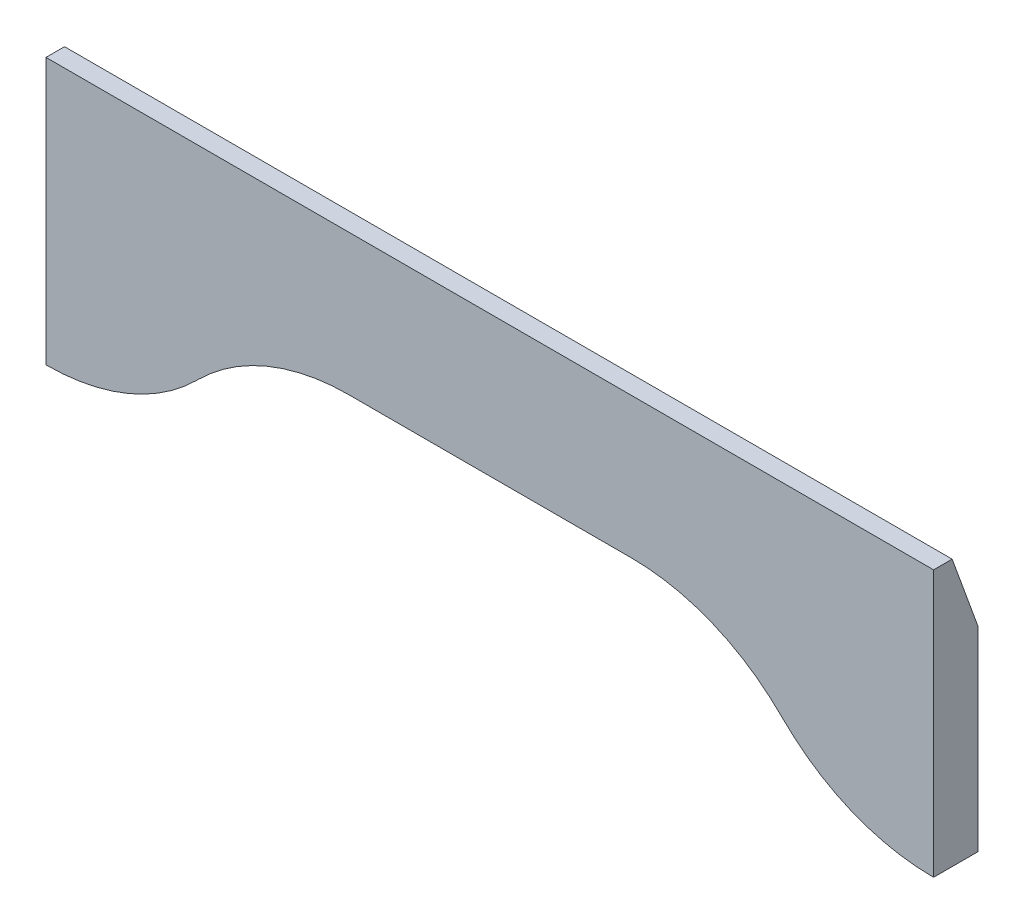
ISO-10303-21;
HEADER;
FILE_DESCRIPTION(('STEP AP214'),'2;1');
FILE_NAME('part.step','',(''),(''),'','','');
FILE_SCHEMA(('AUTOMOTIVE_DESIGN { 1 0 10303 214 1 1 1 1 }'));
ENDSEC;
DATA;
#1=APPLICATION_CONTEXT('core data for automotive mechanical design processes');
#2=APPLICATION_PROTOCOL_DEFINITION('international standard','automotive_design',2000,#1);
#3=PRODUCT_CONTEXT('',#1,'mechanical');
#4=PRODUCT('Part','Part','',(#3));
#5=PRODUCT_RELATED_PRODUCT_CATEGORY('part','',(#4));
#6=PRODUCT_DEFINITION_FORMATION('','',#4);
#7=PRODUCT_DEFINITION_CONTEXT('part definition',#1,'design');
#8=PRODUCT_DEFINITION('design','',#6,#7);
#9=PRODUCT_DEFINITION_SHAPE('','',#8);
#10=(LENGTH_UNIT() NAMED_UNIT(*) SI_UNIT(.MILLI.,.METRE.));
#11=(NAMED_UNIT(*) PLANE_ANGLE_UNIT() SI_UNIT($,.RADIAN.));
#12=(NAMED_UNIT(*) SI_UNIT($,.STERADIAN.) SOLID_ANGLE_UNIT());
#13=UNCERTAINTY_MEASURE_WITH_UNIT(LENGTH_MEASURE(1.E-05),#10,'distance_accuracy_value','');
#14=(GEOMETRIC_REPRESENTATION_CONTEXT(3) GLOBAL_UNCERTAINTY_ASSIGNED_CONTEXT((#13)) GLOBAL_UNIT_ASSIGNED_CONTEXT((#10,
#11,#12)) REPRESENTATION_CONTEXT('',''));
#15=CARTESIAN_POINT('',(0.,0.,0.));
#16=DIRECTION('',(0.,0.,1.));
#17=DIRECTION('',(1.,0.,0.));
#18=AXIS2_PLACEMENT_3D('',#15,#16,#17);
#19=CARTESIAN_POINT('',(0.,0.,6.35));
#20=DIRECTION('',(0.,1.,0.));
#21=DIRECTION('',(0.,0.,1.));
#22=AXIS2_PLACEMENT_3D('',#19,#20,#21);
#23=PLANE('',#22);
#24=DIRECTION('',(1.,0.,0.));
#25=VECTOR('',#24,1.);
#26=CARTESIAN_POINT('',(0.,0.,0.));
#27=LINE('',#26,#25);
#28=CARTESIAN_POINT('',(0.,0.,0.));
#29=VERTEX_POINT('',#28);
#30=CARTESIAN_POINT('',(0.0747706188680307,0.,0.));
#31=VERTEX_POINT('',#30);
#32=EDGE_CURVE('E207',#29,#31,#27,.T.);
#33=ORIENTED_EDGE('',*,*,#32,.T.);
#34=DIRECTION('',(0.,0.,1.));
#35=VECTOR('',#34,1.);
#36=CARTESIAN_POINT('',(0.0747706188680307,0.,6.35));
#37=LINE('',#36,#35);
#38=CARTESIAN_POINT('',(0.0747706188680307,0.,6.35));
#39=VERTEX_POINT('',#38);
#40=EDGE_CURVE('E134',#31,#39,#37,.T.);
#41=ORIENTED_EDGE('',*,*,#40,.T.);
#42=DIRECTION('',(1.,0.,0.));
#43=VECTOR('',#42,1.);
#44=CARTESIAN_POINT('',(0.,0.,6.35));
#45=LINE('',#44,#43);
#46=CARTESIAN_POINT('',(0.,0.,6.35));
#47=VERTEX_POINT('',#46);
#48=EDGE_CURVE('E128',#47,#39,#45,.T.);
#49=ORIENTED_EDGE('',*,*,#48,.F.);
#50=DIRECTION('',(0.,0.,-1.));
#51=VECTOR('',#50,1.);
#52=CARTESIAN_POINT('',(0.,0.,6.35));
#53=LINE('',#52,#51);
#54=EDGE_CURVE('E132',#47,#29,#53,.T.);
#55=ORIENTED_EDGE('',*,*,#54,.T.);
#56=EDGE_LOOP('',(#33,#41,#49,#55));
#57=FACE_BOUND('',#56,.T.);
#58=ADVANCED_FACE('F33',(#57),#23,.F.);
#59=CARTESIAN_POINT('',(0.,0.,6.35));
#60=DIRECTION('',(1.,0.,0.));
#61=DIRECTION('',(0.,0.,-1.));
#62=AXIS2_PLACEMENT_3D('',#59,#60,#61);
#63=PLANE('',#62);
#64=DIRECTION('',(0.,0.,-1.));
#65=VECTOR('',#64,1.);
#66=CARTESIAN_POINT('',(0.,38.1,6.35));
#67=LINE('',#66,#65);
#68=CARTESIAN_POINT('',(0.,38.1,6.35));
#69=VERTEX_POINT('',#68);
#70=CARTESIAN_POINT('',(0.,38.1,3.69793758014461));
#71=VERTEX_POINT('',#70);
#72=EDGE_CURVE('E199',#69,#71,#67,.T.);
#73=ORIENTED_EDGE('',*,*,#72,.T.);
#74=DIRECTION('',(0.,-0.939692620785909,-0.342020143325667));
#75=VECTOR('',#74,1.);
#76=CARTESIAN_POINT('',(0.,38.1,3.69793758014461));
#77=LINE('',#76,#75);
#78=CARTESIAN_POINT('',(0.,27.9399999999999,0.));
#79=VERTEX_POINT('',#78);
#80=EDGE_CURVE('E55',#71,#79,#77,.T.);
#81=ORIENTED_EDGE('',*,*,#80,.T.);
#82=DIRECTION('',(0.,-1.,0.));
#83=VECTOR('',#82,1.);
#84=CARTESIAN_POINT('',(0.,0.,0.));
#85=LINE('',#84,#83);
#86=EDGE_CURVE('E149',#79,#29,#85,.T.);
#87=ORIENTED_EDGE('',*,*,#86,.T.);
#88=ORIENTED_EDGE('',*,*,#54,.F.);
#89=DIRECTION('',(0.,-1.,0.));
#90=VECTOR('',#89,1.);
#91=CARTESIAN_POINT('',(0.,0.,6.35));
#92=LINE('',#91,#90);
#93=EDGE_CURVE('E140',#69,#47,#92,.T.);
#94=ORIENTED_EDGE('',*,*,#93,.F.);
#95=EDGE_LOOP('',(#73,#81,#87,#88,#94));
#96=FACE_BOUND('',#95,.T.);
#97=ADVANCED_FACE('F148',(#96),#63,.F.);
#98=CARTESIAN_POINT('',(126.925229381132,0.,6.35));
#99=VERTEX_POINT('',#98);
#100=CARTESIAN_POINT('',(127.,0.,6.35));
#101=VERTEX_POINT('',#100);
#102=EDGE_CURVE('E137',#99,#101,#45,.T.);
#103=ORIENTED_EDGE('',*,*,#102,.F.);
#104=DIRECTION('',(0.,0.,1.));
#105=VECTOR('',#104,1.);
#106=CARTESIAN_POINT('',(126.925229381132,0.,6.35));
#107=LINE('',#106,#105);
#108=CARTESIAN_POINT('',(126.925229381132,0.,0.));
#109=VERTEX_POINT('',#108);
#110=EDGE_CURVE('E167',#99,#109,#107,.F.);
#111=ORIENTED_EDGE('',*,*,#110,.T.);
#112=CARTESIAN_POINT('',(127.,0.,0.));
#113=VERTEX_POINT('',#112);
#114=EDGE_CURVE('E209',#109,#113,#27,.T.);
#115=ORIENTED_EDGE('',*,*,#114,.T.);
#116=DIRECTION('',(0.,0.,-1.));
#117=VECTOR('',#116,1.);
#118=CARTESIAN_POINT('',(127.,0.,6.35));
#119=LINE('',#118,#117);
#120=EDGE_CURVE('E152',#101,#113,#119,.T.);
#121=ORIENTED_EDGE('',*,*,#120,.F.);
#122=EDGE_LOOP('',(#103,#111,#115,#121));
#123=FACE_BOUND('',#122,.T.);
#124=ADVANCED_FACE('F265',(#123),#23,.F.);
#125=CARTESIAN_POINT('',(127.,0.,6.35));
#126=DIRECTION('',(-1.,0.,0.));
#127=DIRECTION('',(0.,0.,1.));
#128=AXIS2_PLACEMENT_3D('',#125,#126,#127);
#129=PLANE('',#128);
#130=DIRECTION('',(0.,1.,0.));
#131=VECTOR('',#130,1.);
#132=CARTESIAN_POINT('',(127.,0.,0.));
#133=LINE('',#132,#131);
#134=CARTESIAN_POINT('',(127.,27.9399999999999,0.));
#135=VERTEX_POINT('',#134);
#136=EDGE_CURVE('E146',#113,#135,#133,.T.);
#137=ORIENTED_EDGE('',*,*,#136,.T.);
#138=DIRECTION('',(0.,0.939692620785909,0.342020143325667));
#139=VECTOR('',#138,1.);
#140=CARTESIAN_POINT('',(127.,38.1,3.69793758014461));
#141=LINE('',#140,#139);
#142=CARTESIAN_POINT('',(127.,38.1,3.69793758014461));
#143=VERTEX_POINT('',#142);
#144=EDGE_CURVE('E11',#135,#143,#141,.T.);
#145=ORIENTED_EDGE('',*,*,#144,.T.);
#146=DIRECTION('',(0.,0.,-1.));
#147=VECTOR('',#146,1.);
#148=CARTESIAN_POINT('',(127.,38.1,6.35));
#149=LINE('',#148,#147);
#150=CARTESIAN_POINT('',(127.,38.1,6.35));
#151=VERTEX_POINT('',#150);
#152=EDGE_CURVE('E157',#151,#143,#149,.T.);
#153=ORIENTED_EDGE('',*,*,#152,.F.);
#154=DIRECTION('',(0.,1.,0.));
#155=VECTOR('',#154,1.);
#156=CARTESIAN_POINT('',(127.,0.,6.35));
#157=LINE('',#156,#155);
#158=EDGE_CURVE('E136',#101,#151,#157,.T.);
#159=ORIENTED_EDGE('',*,*,#158,.F.);
#160=ORIENTED_EDGE('',*,*,#120,.T.);
#161=EDGE_LOOP('',(#137,#145,#153,#159,#160));
#162=FACE_BOUND('',#161,.T.);
#163=ADVANCED_FACE('F272',(#162),#129,.F.);
#164=CARTESIAN_POINT('',(0.,38.1,6.35));
#165=DIRECTION('',(0.,-1.,0.));
#166=DIRECTION('',(0.,0.,-1.));
#167=AXIS2_PLACEMENT_3D('',#164,#165,#166);
#168=PLANE('',#167);
#169=ORIENTED_EDGE('',*,*,#152,.T.);
#170=DIRECTION('',(-1.,0.,0.));
#171=VECTOR('',#170,1.);
#172=CARTESIAN_POINT('',(0.,38.1,3.69793758014461));
#173=LINE('',#172,#171);
#174=EDGE_CURVE('E192',#143,#71,#173,.T.);
#175=ORIENTED_EDGE('',*,*,#174,.T.);
#176=ORIENTED_EDGE('',*,*,#72,.F.);
#177=DIRECTION('',(-1.,0.,0.));
#178=VECTOR('',#177,1.);
#179=CARTESIAN_POINT('',(0.,38.1,6.35));
#180=LINE('',#179,#178);
#181=EDGE_CURVE('E144',#151,#69,#180,.T.);
#182=ORIENTED_EDGE('',*,*,#181,.F.);
#183=EDGE_LOOP('',(#169,#175,#176,#182));
#184=FACE_BOUND('',#183,.T.);
#185=ADVANCED_FACE('F198',(#184),#168,.F.);
#186=CARTESIAN_POINT('',(0.,0.,6.35));
#187=DIRECTION('',(0.,0.,-1.));
#188=DIRECTION('',(-1.,0.,0.));
#189=AXIS2_PLACEMENT_3D('',#186,#187,#188);
#190=PLANE('',#189);
#191=DIRECTION('',(-0.707106781186547,0.707106781186548,0.));
#192=VECTOR('',#191,1.);
#193=CARTESIAN_POINT('',(96.3394877578617,17.9605122421383,6.35));
#194=LINE('',#193,#192);
#195=CARTESIAN_POINT('',(105.372614690566,8.92738530943406,6.35));
#196=VERTEX_POINT('',#195);
#197=CARTESIAN_POINT('',(105.266873067296,9.03312693270428,6.35));
#198=VERTEX_POINT('',#197);
#199=EDGE_CURVE('E220',#196,#198,#194,.T.);
#200=ORIENTED_EDGE('',*,*,#199,.F.);
#201=CARTESIAN_POINT('',(126.925229381132,30.48,6.35));
#202=DIRECTION('',(0.,0.,-1.));
#203=DIRECTION('',(-1.,0.,0.));
#204=AXIS2_PLACEMENT_3D('',#201,#202,#203);
#205=CIRCLE('',#204,30.48);
#206=EDGE_CURVE('E165',#196,#99,#205,.F.);
#207=ORIENTED_EDGE('',*,*,#206,.T.);
#208=ORIENTED_EDGE('',*,*,#102,.T.);
#209=ORIENTED_EDGE('',*,*,#158,.T.);
#210=ORIENTED_EDGE('',*,*,#181,.T.);
#211=ORIENTED_EDGE('',*,*,#93,.T.);
#212=ORIENTED_EDGE('',*,*,#48,.T.);
#213=CARTESIAN_POINT('',(0.0747706188680307,30.48,6.35));
#214=DIRECTION('',(0.,0.,-1.));
#215=DIRECTION('',(-1.,0.,0.));
#216=AXIS2_PLACEMENT_3D('',#213,#214,#215);
#217=CIRCLE('',#216,30.48);
#218=CARTESIAN_POINT('',(21.627385309434,8.92738530943407,6.35));
#219=VERTEX_POINT('',#218);
#220=EDGE_CURVE('E163',#39,#219,#217,.F.);
#221=ORIENTED_EDGE('',*,*,#220,.T.);
#222=DIRECTION('',(-0.707106781186546,-0.707106781186549,0.));
#223=VECTOR('',#222,1.);
#224=CARTESIAN_POINT('',(12.7,0.,6.35));
#225=LINE('',#224,#223);
#226=CARTESIAN_POINT('',(21.7331269327042,9.03312693270427,6.35));
#227=VERTEX_POINT('',#226);
#228=EDGE_CURVE('E213',#227,#219,#225,.T.);
#229=ORIENTED_EDGE('',*,*,#228,.F.);
#230=CARTESIAN_POINT('',(43.2857416232702,-12.5194877578617,6.35));
#231=DIRECTION('',(0.,0.,-1.));
#232=DIRECTION('',(-1.,0.,0.));
#233=AXIS2_PLACEMENT_3D('',#230,#231,#232);
#234=CIRCLE('',#233,30.48);
#235=CARTESIAN_POINT('',(43.2857416232702,17.9605122421383,6.35));
#236=VERTEX_POINT('',#235);
#237=EDGE_CURVE('E188',#227,#236,#234,.T.);
#238=ORIENTED_EDGE('',*,*,#237,.T.);
#239=DIRECTION('',(-1.,0.,0.));
#240=VECTOR('',#239,1.);
#241=CARTESIAN_POINT('',(30.6605122421383,17.9605122421383,6.35));
#242=LINE('',#241,#240);
#243=CARTESIAN_POINT('',(83.7142583767298,17.9605122421383,6.35));
#244=VERTEX_POINT('',#243);
#245=EDGE_CURVE('E217',#244,#236,#242,.T.);
#246=ORIENTED_EDGE('',*,*,#245,.F.);
#247=CARTESIAN_POINT('',(83.7142583767298,-12.5194877578617,6.35));
#248=DIRECTION('',(0.,0.,-1.));
#249=DIRECTION('',(-1.,0.,0.));
#250=AXIS2_PLACEMENT_3D('',#247,#248,#249);
#251=CIRCLE('',#250,30.48);
#252=EDGE_CURVE('E184',#244,#198,#251,.T.);
#253=ORIENTED_EDGE('',*,*,#252,.T.);
#254=EDGE_LOOP('',(#200,#207,#208,#209,#210,#211,#212,#221,#229,#238,#246,#253));
#255=FACE_BOUND('',#254,.T.);
#256=ADVANCED_FACE('F142',(#255),#190,.F.);
#257=CARTESIAN_POINT('',(0.,0.,0.));
#258=DIRECTION('',(0.,0.,-1.));
#259=DIRECTION('',(-1.,0.,0.));
#260=AXIS2_PLACEMENT_3D('',#257,#258,#259);
#261=PLANE('',#260);
#262=ORIENTED_EDGE('',*,*,#86,.F.);
#263=DIRECTION('',(1.,0.,0.));
#264=VECTOR('',#263,1.);
#265=CARTESIAN_POINT('',(127.,27.9399999999999,0.));
#266=LINE('',#265,#264);
#267=EDGE_CURVE('E41',#79,#135,#266,.T.);
#268=ORIENTED_EDGE('',*,*,#267,.T.);
#269=ORIENTED_EDGE('',*,*,#136,.F.);
#270=ORIENTED_EDGE('',*,*,#114,.F.);
#271=CARTESIAN_POINT('',(126.925229381132,30.48,0.));
#272=DIRECTION('',(0.,0.,-1.));
#273=DIRECTION('',(-1.,0.,0.));
#274=AXIS2_PLACEMENT_3D('',#271,#272,#273);
#275=CIRCLE('',#274,30.48);
#276=CARTESIAN_POINT('',(105.372614690566,8.92738530943406,0.));
#277=VERTEX_POINT('',#276);
#278=EDGE_CURVE('E171',#109,#277,#275,.T.);
#279=ORIENTED_EDGE('',*,*,#278,.T.);
#280=DIRECTION('',(-0.707106781186547,0.707106781186548,0.));
#281=VECTOR('',#280,1.);
#282=CARTESIAN_POINT('',(96.3394877578617,17.9605122421383,0.));
#283=LINE('',#282,#281);
#284=CARTESIAN_POINT('',(105.266873067296,9.03312693270428,0.));
#285=VERTEX_POINT('',#284);
#286=EDGE_CURVE('E216',#277,#285,#283,.T.);
#287=ORIENTED_EDGE('',*,*,#286,.T.);
#288=CARTESIAN_POINT('',(83.7142583767298,-12.5194877578617,0.));
#289=DIRECTION('',(0.,0.,-1.));
#290=DIRECTION('',(-1.,0.,0.));
#291=AXIS2_PLACEMENT_3D('',#288,#289,#290);
#292=CIRCLE('',#291,30.48);
#293=CARTESIAN_POINT('',(83.7142583767298,17.9605122421383,0.));
#294=VERTEX_POINT('',#293);
#295=EDGE_CURVE('E186',#285,#294,#292,.F.);
#296=ORIENTED_EDGE('',*,*,#295,.T.);
#297=DIRECTION('',(-1.,0.,0.));
#298=VECTOR('',#297,1.);
#299=CARTESIAN_POINT('',(30.6605122421383,17.9605122421383,0.));
#300=LINE('',#299,#298);
#301=CARTESIAN_POINT('',(43.2857416232702,17.9605122421383,0.));
#302=VERTEX_POINT('',#301);
#303=EDGE_CURVE('E225',#294,#302,#300,.T.);
#304=ORIENTED_EDGE('',*,*,#303,.T.);
#305=CARTESIAN_POINT('',(43.2857416232702,-12.5194877578617,0.));
#306=DIRECTION('',(0.,0.,-1.));
#307=DIRECTION('',(-1.,0.,0.));
#308=AXIS2_PLACEMENT_3D('',#305,#306,#307);
#309=CIRCLE('',#308,30.48);
#310=CARTESIAN_POINT('',(21.7331269327042,9.03312693270427,0.));
#311=VERTEX_POINT('',#310);
#312=EDGE_CURVE('E190',#302,#311,#309,.F.);
#313=ORIENTED_EDGE('',*,*,#312,.T.);
#314=DIRECTION('',(-0.707106781186546,-0.707106781186549,0.));
#315=VECTOR('',#314,1.);
#316=CARTESIAN_POINT('',(12.7,0.,0.));
#317=LINE('',#316,#315);
#318=CARTESIAN_POINT('',(21.627385309434,8.92738530943407,0.));
#319=VERTEX_POINT('',#318);
#320=EDGE_CURVE('E210',#311,#319,#317,.T.);
#321=ORIENTED_EDGE('',*,*,#320,.T.);
#322=CARTESIAN_POINT('',(0.0747706188680307,30.48,0.));
#323=DIRECTION('',(0.,0.,-1.));
#324=DIRECTION('',(-1.,0.,0.));
#325=AXIS2_PLACEMENT_3D('',#322,#323,#324);
#326=CIRCLE('',#325,30.48);
#327=EDGE_CURVE('E169',#319,#31,#326,.T.);
#328=ORIENTED_EDGE('',*,*,#327,.T.);
#329=ORIENTED_EDGE('',*,*,#32,.F.);
#330=EDGE_LOOP('',(#262,#268,#269,#270,#279,#287,#296,#304,#313,#321,#328,#329));
#331=FACE_BOUND('',#330,.T.);
#332=ADVANCED_FACE('F231',(#331),#261,.T.);
#333=CARTESIAN_POINT('',(12.7,0.,0.));
#334=DIRECTION('',(-0.707106781186549,0.707106781186546,0.));
#335=DIRECTION('',(-0.707106781186546,-0.707106781186549,0.));
#336=AXIS2_PLACEMENT_3D('',#333,#334,#335);
#337=PLANE('',#336);
#338=ORIENTED_EDGE('',*,*,#320,.F.);
#339=DIRECTION('',(0.,0.,1.));
#340=VECTOR('',#339,1.);
#341=CARTESIAN_POINT('',(21.7331269327042,9.03312693270427,6.35));
#342=LINE('',#341,#340);
#343=EDGE_CURVE('E180',#311,#227,#342,.T.);
#344=ORIENTED_EDGE('',*,*,#343,.T.);
#345=ORIENTED_EDGE('',*,*,#228,.T.);
#346=DIRECTION('',(0.,0.,1.));
#347=VECTOR('',#346,1.);
#348=CARTESIAN_POINT('',(21.627385309434,8.92738530943407,0.));
#349=LINE('',#348,#347);
#350=EDGE_CURVE('E178',#219,#319,#349,.F.);
#351=ORIENTED_EDGE('',*,*,#350,.T.);
#352=EDGE_LOOP('',(#338,#344,#345,#351));
#353=FACE_BOUND('',#352,.T.);
#354=ADVANCED_FACE('F252',(#353),#337,.F.);
#355=CARTESIAN_POINT('',(30.6605122421383,17.9605122421383,0.));
#356=DIRECTION('',(0.,1.,0.));
#357=DIRECTION('',(0.,0.,1.));
#358=AXIS2_PLACEMENT_3D('',#355,#356,#357);
#359=PLANE('',#358);
#360=ORIENTED_EDGE('',*,*,#303,.F.);
#361=DIRECTION('',(0.,0.,1.));
#362=VECTOR('',#361,1.);
#363=CARTESIAN_POINT('',(83.7142583767298,17.9605122421383,6.35));
#364=LINE('',#363,#362);
#365=EDGE_CURVE('E175',#294,#244,#364,.T.);
#366=ORIENTED_EDGE('',*,*,#365,.T.);
#367=ORIENTED_EDGE('',*,*,#245,.T.);
#368=DIRECTION('',(0.,0.,1.));
#369=VECTOR('',#368,1.);
#370=CARTESIAN_POINT('',(43.2857416232702,17.9605122421383,0.));
#371=LINE('',#370,#369);
#372=EDGE_CURVE('E173',#236,#302,#371,.F.);
#373=ORIENTED_EDGE('',*,*,#372,.T.);
#374=EDGE_LOOP('',(#360,#366,#367,#373));
#375=FACE_BOUND('',#374,.T.);
#376=ADVANCED_FACE('F243',(#375),#359,.F.);
#377=CARTESIAN_POINT('',(96.3394877578617,17.9605122421383,0.));
#378=DIRECTION('',(0.707106781186548,0.707106781186547,0.));
#379=DIRECTION('',(-0.707106781186547,0.707106781186548,0.));
#380=AXIS2_PLACEMENT_3D('',#377,#378,#379);
#381=PLANE('',#380);
#382=ORIENTED_EDGE('',*,*,#286,.F.);
#383=DIRECTION('',(0.,0.,1.));
#384=VECTOR('',#383,1.);
#385=CARTESIAN_POINT('',(105.372614690566,8.92738530943406,0.));
#386=LINE('',#385,#384);
#387=EDGE_CURVE('E154',#277,#196,#386,.T.);
#388=ORIENTED_EDGE('',*,*,#387,.T.);
#389=ORIENTED_EDGE('',*,*,#199,.T.);
#390=DIRECTION('',(0.,0.,1.));
#391=VECTOR('',#390,1.);
#392=CARTESIAN_POINT('',(105.266873067296,9.03312693270428,0.));
#393=LINE('',#392,#391);
#394=EDGE_CURVE('E151',#198,#285,#393,.F.);
#395=ORIENTED_EDGE('',*,*,#394,.T.);
#396=EDGE_LOOP('',(#382,#388,#389,#395));
#397=FACE_BOUND('',#396,.T.);
#398=ADVANCED_FACE('F284',(#397),#381,.F.);
#399=CARTESIAN_POINT('',(126.925229381132,30.48,0.));
#400=DIRECTION('',(0.,0.,1.));
#401=DIRECTION('',(1.,0.,0.));
#402=AXIS2_PLACEMENT_3D('',#399,#400,#401);
#403=CYLINDRICAL_SURFACE('',#402,30.48);
#404=ORIENTED_EDGE('',*,*,#278,.F.);
#405=ORIENTED_EDGE('',*,*,#110,.F.);
#406=ORIENTED_EDGE('',*,*,#206,.F.);
#407=ORIENTED_EDGE('',*,*,#387,.F.);
#408=EDGE_LOOP('',(#404,#405,#406,#407));
#409=FACE_BOUND('',#408,.T.);
#410=ADVANCED_FACE('F283',(#409),#403,.T.);
#411=CARTESIAN_POINT('',(83.7142583767298,-12.5194877578617,0.));
#412=DIRECTION('',(0.,0.,-1.));
#413=DIRECTION('',(-1.,0.,0.));
#414=AXIS2_PLACEMENT_3D('',#411,#412,#413);
#415=CYLINDRICAL_SURFACE('',#414,30.48);
#416=ORIENTED_EDGE('',*,*,#295,.F.);
#417=ORIENTED_EDGE('',*,*,#394,.F.);
#418=ORIENTED_EDGE('',*,*,#252,.F.);
#419=ORIENTED_EDGE('',*,*,#365,.F.);
#420=EDGE_LOOP('',(#416,#417,#418,#419));
#421=FACE_BOUND('',#420,.T.);
#422=ADVANCED_FACE('F240',(#421),#415,.F.);
#423=CARTESIAN_POINT('',(43.2857416232702,-12.5194877578617,0.));
#424=DIRECTION('',(0.,0.,-1.));
#425=DIRECTION('',(-1.,0.,0.));
#426=AXIS2_PLACEMENT_3D('',#423,#424,#425);
#427=CYLINDRICAL_SURFACE('',#426,30.48);
#428=ORIENTED_EDGE('',*,*,#312,.F.);
#429=ORIENTED_EDGE('',*,*,#372,.F.);
#430=ORIENTED_EDGE('',*,*,#237,.F.);
#431=ORIENTED_EDGE('',*,*,#343,.F.);
#432=EDGE_LOOP('',(#428,#429,#430,#431));
#433=FACE_BOUND('',#432,.T.);
#434=ADVANCED_FACE('F249',(#433),#427,.F.);
#435=CARTESIAN_POINT('',(0.0747706188680307,30.48,6.35));
#436=DIRECTION('',(0.,0.,1.));
#437=DIRECTION('',(1.,0.,0.));
#438=AXIS2_PLACEMENT_3D('',#435,#436,#437);
#439=CYLINDRICAL_SURFACE('',#438,30.48);
#440=ORIENTED_EDGE('',*,*,#327,.F.);
#441=ORIENTED_EDGE('',*,*,#350,.F.);
#442=ORIENTED_EDGE('',*,*,#220,.F.);
#443=ORIENTED_EDGE('',*,*,#40,.F.);
#444=EDGE_LOOP('',(#440,#441,#442,#443));
#445=FACE_BOUND('',#444,.T.);
#446=ADVANCED_FACE('F256',(#445),#439,.T.);
#447=CARTESIAN_POINT('',(0.,38.1,3.69793758014461));
#448=DIRECTION('',(0.,0.342020143325667,-0.939692620785909));
#449=DIRECTION('',(1.,0.,0.));
#450=AXIS2_PLACEMENT_3D('',#447,#448,#449);
#451=PLANE('',#450);
#452=ORIENTED_EDGE('',*,*,#144,.F.);
#453=ORIENTED_EDGE('',*,*,#267,.F.);
#454=ORIENTED_EDGE('',*,*,#80,.F.);
#455=ORIENTED_EDGE('',*,*,#174,.F.);
#456=EDGE_LOOP('',(#452,#453,#454,#455));
#457=FACE_BOUND('',#456,.T.);
#458=ADVANCED_FACE('F35',(#457),#451,.T.);
#459=CLOSED_SHELL('',(#58,#97,#124,#163,#185,#256,#332,#354,#376,#398,#410,#422,#434,#446,#458));
#460=MANIFOLD_SOLID_BREP('B2',#459);
#461=ADVANCED_BREP_SHAPE_REPRESENTATION('',(#18,#460),#14);
#462=SHAPE_DEFINITION_REPRESENTATION(#9,#461);
ENDSEC;
END-ISO-10303-21;
